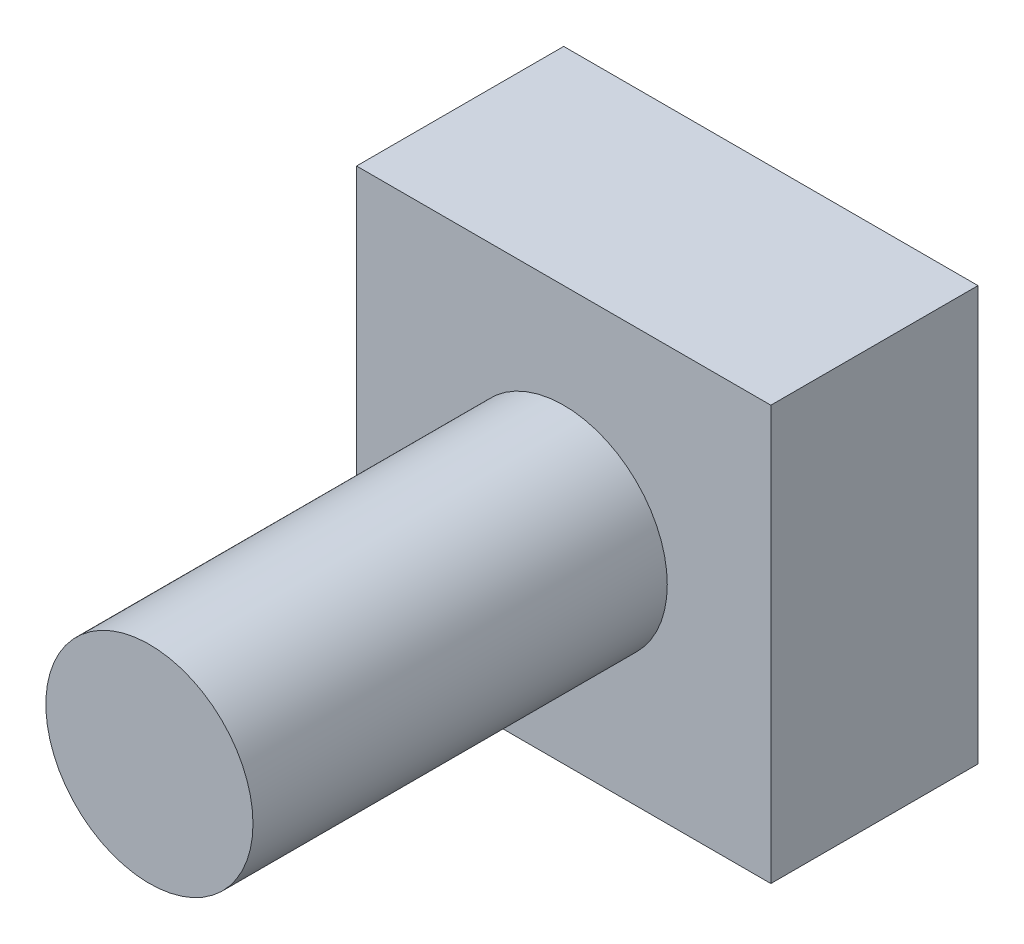
ISO-10303-21;
HEADER;
FILE_DESCRIPTION(('STEP AP214'),'2;1');
FILE_NAME('part.step','',(''),(''),'','','');
FILE_SCHEMA(('AUTOMOTIVE_DESIGN { 1 0 10303 214 1 1 1 1 }'));
ENDSEC;
DATA;
#1=APPLICATION_CONTEXT('core data for automotive mechanical design processes');
#2=APPLICATION_PROTOCOL_DEFINITION('international standard','automotive_design',2000,#1);
#3=PRODUCT_CONTEXT('',#1,'mechanical');
#4=PRODUCT('Part','Part','',(#3));
#5=PRODUCT_RELATED_PRODUCT_CATEGORY('part','',(#4));
#6=PRODUCT_DEFINITION_FORMATION('','',#4);
#7=PRODUCT_DEFINITION_CONTEXT('part definition',#1,'design');
#8=PRODUCT_DEFINITION('design','',#6,#7);
#9=PRODUCT_DEFINITION_SHAPE('','',#8);
#10=(LENGTH_UNIT() NAMED_UNIT(*) SI_UNIT(.MILLI.,.METRE.));
#11=(NAMED_UNIT(*) PLANE_ANGLE_UNIT() SI_UNIT($,.RADIAN.));
#12=(NAMED_UNIT(*) SI_UNIT($,.STERADIAN.) SOLID_ANGLE_UNIT());
#13=UNCERTAINTY_MEASURE_WITH_UNIT(LENGTH_MEASURE(1.E-05),#10,'distance_accuracy_value','');
#14=(GEOMETRIC_REPRESENTATION_CONTEXT(3) GLOBAL_UNCERTAINTY_ASSIGNED_CONTEXT((#13)) GLOBAL_UNIT_ASSIGNED_CONTEXT((#10,
#11,#12)) REPRESENTATION_CONTEXT('',''));
#15=CARTESIAN_POINT('',(0.,0.,0.));
#16=DIRECTION('',(0.,0.,1.));
#17=DIRECTION('',(1.,0.,0.));
#18=AXIS2_PLACEMENT_3D('',#15,#16,#17);
#19=CARTESIAN_POINT('',(0.,0.,6.35));
#20=DIRECTION('',(0.,1.,0.));
#21=DIRECTION('',(-1.,0.,0.));
#22=AXIS2_PLACEMENT_3D('',#19,#20,#21);
#23=PLANE('',#22);
#24=DIRECTION('',(1.,0.,0.));
#25=VECTOR('',#24,1.);
#26=CARTESIAN_POINT('',(0.,0.,0.));
#27=LINE('',#26,#25);
#28=CARTESIAN_POINT('',(0.,0.,0.));
#29=VERTEX_POINT('',#28);
#30=CARTESIAN_POINT('',(12.7,0.,0.));
#31=VERTEX_POINT('',#30);
#32=EDGE_CURVE('E96',#29,#31,#27,.T.);
#33=ORIENTED_EDGE('',*,*,#32,.T.);
#34=DIRECTION('',(0.,0.,-1.));
#35=VECTOR('',#34,1.);
#36=CARTESIAN_POINT('',(12.7,0.,6.35));
#37=LINE('',#36,#35);
#38=CARTESIAN_POINT('',(12.7,0.,6.35));
#39=VERTEX_POINT('',#38);
#40=EDGE_CURVE('E11',#39,#31,#37,.T.);
#41=ORIENTED_EDGE('',*,*,#40,.F.);
#42=DIRECTION('',(1.,0.,0.));
#43=VECTOR('',#42,1.);
#44=CARTESIAN_POINT('',(0.,0.,6.35));
#45=LINE('',#44,#43);
#46=CARTESIAN_POINT('',(0.,0.,6.35));
#47=VERTEX_POINT('',#46);
#48=EDGE_CURVE('E82',#47,#39,#45,.T.);
#49=ORIENTED_EDGE('',*,*,#48,.F.);
#50=DIRECTION('',(0.,0.,-1.));
#51=VECTOR('',#50,1.);
#52=CARTESIAN_POINT('',(0.,0.,6.35));
#53=LINE('',#52,#51);
#54=EDGE_CURVE('E49',#47,#29,#53,.T.);
#55=ORIENTED_EDGE('',*,*,#54,.T.);
#56=EDGE_LOOP('',(#33,#41,#49,#55));
#57=FACE_BOUND('',#56,.T.);
#58=ADVANCED_FACE('F33',(#57),#23,.F.);
#59=CARTESIAN_POINT('',(12.7,0.,6.35));
#60=DIRECTION('',(-1.,0.,0.));
#61=DIRECTION('',(0.,-1.,0.));
#62=AXIS2_PLACEMENT_3D('',#59,#60,#61);
#63=PLANE('',#62);
#64=DIRECTION('',(0.,1.,0.));
#65=VECTOR('',#64,1.);
#66=CARTESIAN_POINT('',(12.7,0.,0.));
#67=LINE('',#66,#65);
#68=CARTESIAN_POINT('',(12.7,12.7,0.));
#69=VERTEX_POINT('',#68);
#70=EDGE_CURVE('E87',#31,#69,#67,.T.);
#71=ORIENTED_EDGE('',*,*,#70,.T.);
#72=DIRECTION('',(0.,0.,-1.));
#73=VECTOR('',#72,1.);
#74=CARTESIAN_POINT('',(12.7,12.7,6.35));
#75=LINE('',#74,#73);
#76=CARTESIAN_POINT('',(12.7,12.7,6.35));
#77=VERTEX_POINT('',#76);
#78=EDGE_CURVE('E41',#77,#69,#75,.T.);
#79=ORIENTED_EDGE('',*,*,#78,.F.);
#80=DIRECTION('',(0.,1.,0.));
#81=VECTOR('',#80,1.);
#82=CARTESIAN_POINT('',(12.7,0.,6.35));
#83=LINE('',#82,#81);
#84=EDGE_CURVE('E74',#39,#77,#83,.T.);
#85=ORIENTED_EDGE('',*,*,#84,.F.);
#86=ORIENTED_EDGE('',*,*,#40,.T.);
#87=EDGE_LOOP('',(#71,#79,#85,#86));
#88=FACE_BOUND('',#87,.T.);
#89=ADVANCED_FACE('F86',(#88),#63,.F.);
#90=CARTESIAN_POINT('',(0.,12.7,6.35));
#91=DIRECTION('',(0.,1.,0.));
#92=DIRECTION('',(-1.,0.,0.));
#93=AXIS2_PLACEMENT_3D('',#90,#91,#92);
#94=PLANE('',#93);
#95=DIRECTION('',(1.,0.,0.));
#96=VECTOR('',#95,1.);
#97=CARTESIAN_POINT('',(0.,12.7,0.));
#98=LINE('',#97,#96);
#99=CARTESIAN_POINT('',(0.,12.7,0.));
#100=VERTEX_POINT('',#99);
#101=EDGE_CURVE('E100',#100,#69,#98,.T.);
#102=ORIENTED_EDGE('',*,*,#101,.F.);
#103=DIRECTION('',(0.,0.,-1.));
#104=VECTOR('',#103,1.);
#105=CARTESIAN_POINT('',(0.,12.7,6.35));
#106=LINE('',#105,#104);
#107=CARTESIAN_POINT('',(0.,12.7,6.35));
#108=VERTEX_POINT('',#107);
#109=EDGE_CURVE('E63',#108,#100,#106,.T.);
#110=ORIENTED_EDGE('',*,*,#109,.F.);
#111=DIRECTION('',(1.,0.,0.));
#112=VECTOR('',#111,1.);
#113=CARTESIAN_POINT('',(0.,12.7,6.35));
#114=LINE('',#113,#112);
#115=EDGE_CURVE('E81',#108,#77,#114,.T.);
#116=ORIENTED_EDGE('',*,*,#115,.T.);
#117=ORIENTED_EDGE('',*,*,#78,.T.);
#118=EDGE_LOOP('',(#102,#110,#116,#117));
#119=FACE_BOUND('',#118,.T.);
#120=ADVANCED_FACE('F90',(#119),#94,.T.);
#121=CARTESIAN_POINT('',(0.,0.,6.35));
#122=DIRECTION('',(-1.,0.,0.));
#123=DIRECTION('',(0.,-1.,0.));
#124=AXIS2_PLACEMENT_3D('',#121,#122,#123);
#125=PLANE('',#124);
#126=DIRECTION('',(0.,1.,0.));
#127=VECTOR('',#126,1.);
#128=CARTESIAN_POINT('',(0.,0.,0.));
#129=LINE('',#128,#127);
#130=EDGE_CURVE('E102',#29,#100,#129,.T.);
#131=ORIENTED_EDGE('',*,*,#130,.F.);
#132=ORIENTED_EDGE('',*,*,#54,.F.);
#133=DIRECTION('',(0.,1.,0.));
#134=VECTOR('',#133,1.);
#135=CARTESIAN_POINT('',(0.,0.,6.35));
#136=LINE('',#135,#134);
#137=EDGE_CURVE('E91',#47,#108,#136,.T.);
#138=ORIENTED_EDGE('',*,*,#137,.T.);
#139=ORIENTED_EDGE('',*,*,#109,.T.);
#140=EDGE_LOOP('',(#131,#132,#138,#139));
#141=FACE_BOUND('',#140,.T.);
#142=ADVANCED_FACE('F124',(#141),#125,.T.);
#143=CARTESIAN_POINT('',(0.,0.,6.35));
#144=DIRECTION('',(0.,0.,1.));
#145=DIRECTION('',(1.,0.,0.));
#146=AXIS2_PLACEMENT_3D('',#143,#144,#145);
#147=PLANE('',#146);
#148=CARTESIAN_POINT('',(6.35,6.35,6.35));
#149=DIRECTION('',(0.,0.,1.));
#150=DIRECTION('',(1.,0.,0.));
#151=AXIS2_PLACEMENT_3D('',#148,#149,#150);
#152=CIRCLE('',#151,3.175);
#153=CARTESIAN_POINT('',(9.525,6.35,6.35));
#154=VERTEX_POINT('',#153);
#155=EDGE_CURVE('E108',#154,#154,#152,.T.);
#156=ORIENTED_EDGE('',*,*,#155,.F.);
#157=EDGE_LOOP('',(#156));
#158=FACE_BOUND('',#157,.T.);
#159=ORIENTED_EDGE('',*,*,#48,.T.);
#160=ORIENTED_EDGE('',*,*,#84,.T.);
#161=ORIENTED_EDGE('',*,*,#115,.F.);
#162=ORIENTED_EDGE('',*,*,#137,.F.);
#163=EDGE_LOOP('',(#159,#160,#161,#162));
#164=FACE_BOUND('',#163,.T.);
#165=ADVANCED_FACE('F78',(#158,#164),#147,.T.);
#166=CARTESIAN_POINT('',(0.,0.,0.));
#167=DIRECTION('',(0.,0.,1.));
#168=DIRECTION('',(1.,0.,0.));
#169=AXIS2_PLACEMENT_3D('',#166,#167,#168);
#170=PLANE('',#169);
#171=ORIENTED_EDGE('',*,*,#32,.F.);
#172=ORIENTED_EDGE('',*,*,#130,.T.);
#173=ORIENTED_EDGE('',*,*,#101,.T.);
#174=ORIENTED_EDGE('',*,*,#70,.F.);
#175=EDGE_LOOP('',(#171,#172,#173,#174));
#176=FACE_BOUND('',#175,.T.);
#177=ADVANCED_FACE('F119',(#176),#170,.F.);
#178=CARTESIAN_POINT('',(6.35,6.35,19.05));
#179=DIRECTION('',(0.,0.,-1.));
#180=DIRECTION('',(-1.,0.,0.));
#181=AXIS2_PLACEMENT_3D('',#178,#179,#180);
#182=CYLINDRICAL_SURFACE('',#181,3.175);
#183=CARTESIAN_POINT('',(6.35,6.35,19.05));
#184=DIRECTION('',(0.,0.,1.));
#185=DIRECTION('',(1.,0.,0.));
#186=AXIS2_PLACEMENT_3D('',#183,#184,#185);
#187=CIRCLE('',#186,3.175);
#188=CARTESIAN_POINT('',(9.525,6.35,19.05));
#189=VERTEX_POINT('',#188);
#190=EDGE_CURVE('E98',#189,#189,#187,.T.);
#191=ORIENTED_EDGE('',*,*,#190,.F.);
#192=EDGE_LOOP('',(#191));
#193=FACE_BOUND('',#192,.T.);
#194=ORIENTED_EDGE('',*,*,#155,.T.);
#195=EDGE_LOOP('',(#194));
#196=FACE_BOUND('',#195,.T.);
#197=ADVANCED_FACE('F116',(#193,#196),#182,.T.);
#198=CARTESIAN_POINT('',(6.35,6.35,19.05));
#199=DIRECTION('',(0.,0.,1.));
#200=DIRECTION('',(1.,0.,0.));
#201=AXIS2_PLACEMENT_3D('',#198,#199,#200);
#202=PLANE('',#201);
#203=ORIENTED_EDGE('',*,*,#190,.T.);
#204=EDGE_LOOP('',(#203));
#205=FACE_BOUND('',#204,.T.);
#206=ADVANCED_FACE('F114',(#205),#202,.T.);
#207=CLOSED_SHELL('',(#58,#89,#120,#142,#165,#177,#197,#206));
#208=MANIFOLD_SOLID_BREP('B2',#207);
#209=ADVANCED_BREP_SHAPE_REPRESENTATION('',(#18,#208),#14);
#210=SHAPE_DEFINITION_REPRESENTATION(#9,#209);
ENDSEC;
END-ISO-10303-21;
